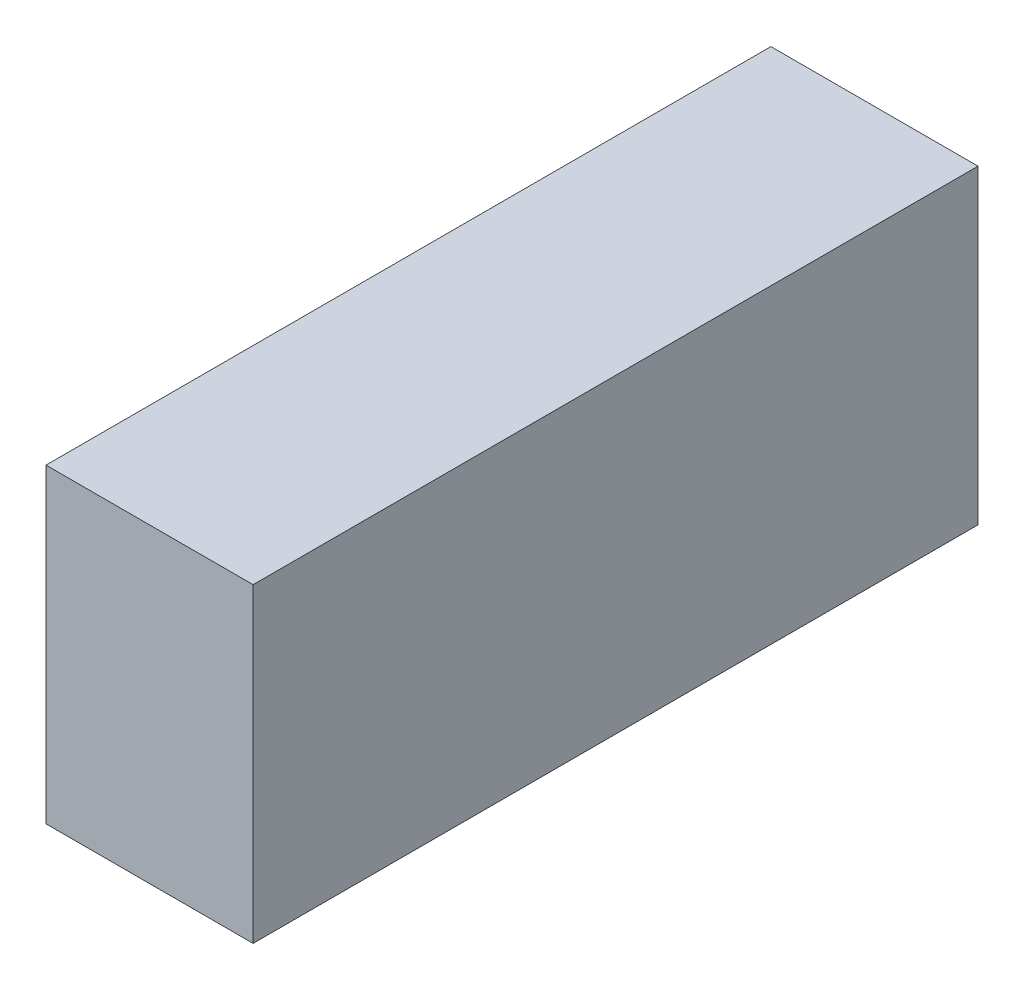
ISO-10303-21;
HEADER;
FILE_DESCRIPTION(('STEP AP214'),'2;1');
FILE_NAME('part.step','',(''),(''),'','','');
FILE_SCHEMA(('AUTOMOTIVE_DESIGN { 1 0 10303 214 1 1 1 1 }'));
ENDSEC;
DATA;
#1=APPLICATION_CONTEXT('core data for automotive mechanical design processes');
#2=APPLICATION_PROTOCOL_DEFINITION('international standard','automotive_design',2000,#1);
#3=PRODUCT_CONTEXT('',#1,'mechanical');
#4=PRODUCT('Part','Part','',(#3));
#5=PRODUCT_RELATED_PRODUCT_CATEGORY('part','',(#4));
#6=PRODUCT_DEFINITION_FORMATION('','',#4);
#7=PRODUCT_DEFINITION_CONTEXT('part definition',#1,'design');
#8=PRODUCT_DEFINITION('design','',#6,#7);
#9=PRODUCT_DEFINITION_SHAPE('','',#8);
#10=(LENGTH_UNIT() NAMED_UNIT(*) SI_UNIT(.MILLI.,.METRE.));
#11=(NAMED_UNIT(*) PLANE_ANGLE_UNIT() SI_UNIT($,.RADIAN.));
#12=(NAMED_UNIT(*) SI_UNIT($,.STERADIAN.) SOLID_ANGLE_UNIT());
#13=UNCERTAINTY_MEASURE_WITH_UNIT(LENGTH_MEASURE(1.E-05),#10,'distance_accuracy_value','');
#14=(GEOMETRIC_REPRESENTATION_CONTEXT(3) GLOBAL_UNCERTAINTY_ASSIGNED_CONTEXT((#13)) GLOBAL_UNIT_ASSIGNED_CONTEXT((#10,
#11,#12)) REPRESENTATION_CONTEXT('',''));
#15=CARTESIAN_POINT('',(0.,0.,0.));
#16=DIRECTION('',(0.,0.,1.));
#17=DIRECTION('',(1.,0.,0.));
#18=AXIS2_PLACEMENT_3D('',#15,#16,#17);
#19=CARTESIAN_POINT('',(-0.09999980000001,0.1499997,0.));
#20=DIRECTION('',(1.,0.,0.));
#21=DIRECTION('',(0.,0.,-1.));
#22=AXIS2_PLACEMENT_3D('',#19,#20,#21);
#23=PLANE('',#22);
#24=DIRECTION('',(0.,0.,1.));
#25=VECTOR('',#24,1.);
#26=CARTESIAN_POINT('',(-0.09999980000001,-0.1499997,0.));
#27=LINE('',#26,#25);
#28=CARTESIAN_POINT('',(-0.09999980000001,-0.1499997,0.));
#29=VERTEX_POINT('',#28);
#30=CARTESIAN_POINT('',(-0.09999980000001,-0.1499997,0.70000114));
#31=VERTEX_POINT('',#30);
#32=EDGE_CURVE('E20',#29,#31,#27,.T.);
#33=ORIENTED_EDGE('',*,*,#32,.T.);
#34=DIRECTION('',(0.,1.,0.));
#35=VECTOR('',#34,1.);
#36=CARTESIAN_POINT('',(-0.09999980000001,-0.1499997,0.70000114));
#37=LINE('',#36,#35);
#38=CARTESIAN_POINT('',(-0.09999980000001,0.1499997,0.70000114));
#39=VERTEX_POINT('',#38);
#40=EDGE_CURVE('E55',#31,#39,#37,.T.);
#41=ORIENTED_EDGE('',*,*,#40,.T.);
#42=DIRECTION('',(0.,0.,-1.));
#43=VECTOR('',#42,1.);
#44=CARTESIAN_POINT('',(-0.09999980000001,0.1499997,0.));
#45=LINE('',#44,#43);
#46=CARTESIAN_POINT('',(-0.09999980000001,0.1499997,0.));
#47=VERTEX_POINT('',#46);
#48=EDGE_CURVE('E76',#39,#47,#45,.T.);
#49=ORIENTED_EDGE('',*,*,#48,.T.);
#50=DIRECTION('',(0.,1.,0.));
#51=VECTOR('',#50,1.);
#52=CARTESIAN_POINT('',(-0.09999980000001,-0.1499997,0.));
#53=LINE('',#52,#51);
#54=EDGE_CURVE('E58',#29,#47,#53,.T.);
#55=ORIENTED_EDGE('',*,*,#54,.F.);
#56=EDGE_LOOP('',(#33,#41,#49,#55));
#57=FACE_BOUND('',#56,.T.);
#58=ADVANCED_FACE('F17',(#57),#23,.F.);
#59=CARTESIAN_POINT('',(-0.09999980000001,-0.1499997,0.));
#60=DIRECTION('',(0.,1.,0.));
#61=DIRECTION('',(0.,0.,1.));
#62=AXIS2_PLACEMENT_3D('',#59,#60,#61);
#63=PLANE('',#62);
#64=DIRECTION('',(0.,0.,1.));
#65=VECTOR('',#64,1.);
#66=CARTESIAN_POINT('',(0.09999979999999,-0.1499997,0.));
#67=LINE('',#66,#65);
#68=CARTESIAN_POINT('',(0.09999979999999,-0.1499997,0.));
#69=VERTEX_POINT('',#68);
#70=CARTESIAN_POINT('',(0.09999979999999,-0.1499997,0.70000114));
#71=VERTEX_POINT('',#70);
#72=EDGE_CURVE('E73',#69,#71,#67,.T.);
#73=ORIENTED_EDGE('',*,*,#72,.T.);
#74=DIRECTION('',(-1.,0.,0.));
#75=VECTOR('',#74,1.);
#76=CARTESIAN_POINT('',(0.09999979999999,-0.1499997,0.70000114));
#77=LINE('',#76,#75);
#78=EDGE_CURVE('E63',#71,#31,#77,.T.);
#79=ORIENTED_EDGE('',*,*,#78,.T.);
#80=ORIENTED_EDGE('',*,*,#32,.F.);
#81=DIRECTION('',(-1.,0.,0.));
#82=VECTOR('',#81,1.);
#83=CARTESIAN_POINT('',(0.09999979999999,-0.1499997,0.));
#84=LINE('',#83,#82);
#85=EDGE_CURVE('E78',#69,#29,#84,.T.);
#86=ORIENTED_EDGE('',*,*,#85,.F.);
#87=EDGE_LOOP('',(#73,#79,#80,#86));
#88=FACE_BOUND('',#87,.T.);
#89=ADVANCED_FACE('F72',(#88),#63,.F.);
#90=CARTESIAN_POINT('',(0.09999979999999,-0.1499997,0.70000114));
#91=DIRECTION('',(0.,0.,-1.));
#92=DIRECTION('',(-1.,0.,0.));
#93=AXIS2_PLACEMENT_3D('',#90,#91,#92);
#94=PLANE('',#93);
#95=DIRECTION('',(1.,0.,0.));
#96=VECTOR('',#95,1.);
#97=CARTESIAN_POINT('',(0.09999979999999,0.1499997,0.70000114));
#98=LINE('',#97,#96);
#99=CARTESIAN_POINT('',(0.09999979999999,0.1499997,0.70000114));
#100=VERTEX_POINT('',#99);
#101=EDGE_CURVE('E69',#100,#39,#98,.F.);
#102=ORIENTED_EDGE('',*,*,#101,.T.);
#103=ORIENTED_EDGE('',*,*,#40,.F.);
#104=ORIENTED_EDGE('',*,*,#78,.F.);
#105=DIRECTION('',(0.,1.,0.));
#106=VECTOR('',#105,1.);
#107=CARTESIAN_POINT('',(0.09999979999999,-0.1499997,0.70000114));
#108=LINE('',#107,#106);
#109=EDGE_CURVE('E83',#71,#100,#108,.T.);
#110=ORIENTED_EDGE('',*,*,#109,.T.);
#111=EDGE_LOOP('',(#102,#103,#104,#110));
#112=FACE_BOUND('',#111,.T.);
#113=ADVANCED_FACE('F66',(#112),#94,.F.);
#114=CARTESIAN_POINT('',(0.09999979999999,0.1499997,0.));
#115=DIRECTION('',(0.,-1.,0.));
#116=DIRECTION('',(0.,0.,-1.));
#117=AXIS2_PLACEMENT_3D('',#114,#115,#116);
#118=PLANE('',#117);
#119=ORIENTED_EDGE('',*,*,#48,.F.);
#120=ORIENTED_EDGE('',*,*,#101,.F.);
#121=DIRECTION('',(0.,0.,1.));
#122=VECTOR('',#121,1.);
#123=CARTESIAN_POINT('',(0.09999979999999,0.1499997,0.));
#124=LINE('',#123,#122);
#125=CARTESIAN_POINT('',(0.09999979999999,0.1499997,0.));
#126=VERTEX_POINT('',#125);
#127=EDGE_CURVE('E26',#100,#126,#124,.F.);
#128=ORIENTED_EDGE('',*,*,#127,.T.);
#129=DIRECTION('',(-1.,0.,0.));
#130=VECTOR('',#129,1.);
#131=CARTESIAN_POINT('',(0.09999979999999,0.1499997,0.));
#132=LINE('',#131,#130);
#133=EDGE_CURVE('E34',#47,#126,#132,.F.);
#134=ORIENTED_EDGE('',*,*,#133,.F.);
#135=EDGE_LOOP('',(#119,#120,#128,#134));
#136=FACE_BOUND('',#135,.T.);
#137=ADVANCED_FACE('F88',(#136),#118,.F.);
#138=CARTESIAN_POINT('',(0.09999979999999,-0.1499997,0.));
#139=DIRECTION('',(0.,0.,-1.));
#140=DIRECTION('',(-1.,0.,0.));
#141=AXIS2_PLACEMENT_3D('',#138,#139,#140);
#142=PLANE('',#141);
#143=ORIENTED_EDGE('',*,*,#133,.T.);
#144=DIRECTION('',(0.,1.,0.));
#145=VECTOR('',#144,1.);
#146=CARTESIAN_POINT('',(0.09999979999999,-0.1499997,0.));
#147=LINE('',#146,#145);
#148=EDGE_CURVE('E11',#126,#69,#147,.F.);
#149=ORIENTED_EDGE('',*,*,#148,.T.);
#150=ORIENTED_EDGE('',*,*,#85,.T.);
#151=ORIENTED_EDGE('',*,*,#54,.T.);
#152=EDGE_LOOP('',(#143,#149,#150,#151));
#153=FACE_BOUND('',#152,.T.);
#154=ADVANCED_FACE('F91',(#153),#142,.T.);
#155=CARTESIAN_POINT('',(0.09999979999999,-0.1499997,0.));
#156=DIRECTION('',(-1.,0.,0.));
#157=DIRECTION('',(0.,0.,1.));
#158=AXIS2_PLACEMENT_3D('',#155,#156,#157);
#159=PLANE('',#158);
#160=ORIENTED_EDGE('',*,*,#127,.F.);
#161=ORIENTED_EDGE('',*,*,#109,.F.);
#162=ORIENTED_EDGE('',*,*,#72,.F.);
#163=ORIENTED_EDGE('',*,*,#148,.F.);
#164=EDGE_LOOP('',(#160,#161,#162,#163));
#165=FACE_BOUND('',#164,.T.);
#166=ADVANCED_FACE('F90',(#165),#159,.F.);
#167=CLOSED_SHELL('',(#58,#89,#113,#137,#154,#166));
#168=MANIFOLD_SOLID_BREP('B1',#167);
#169=ADVANCED_BREP_SHAPE_REPRESENTATION('',(#18,#168),#14);
#170=SHAPE_DEFINITION_REPRESENTATION(#9,#169);
ENDSEC;
END-ISO-10303-21;
